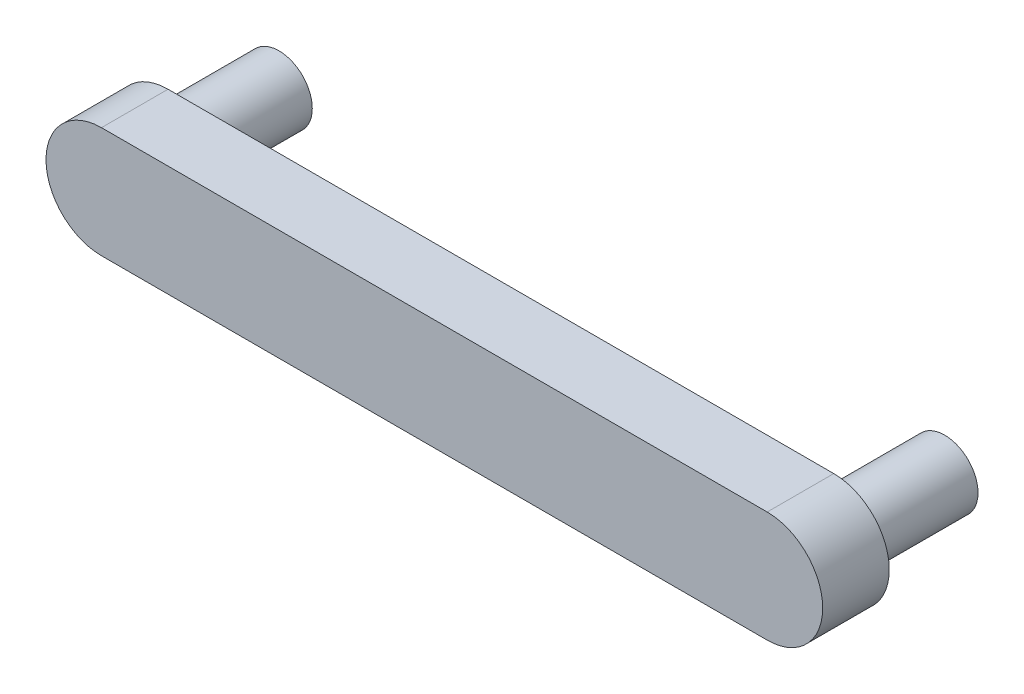
ISO-10303-21;
HEADER;
FILE_DESCRIPTION(('STEP AP214'),'2;1');
FILE_NAME('part.step','',(''),(''),'','','');
FILE_SCHEMA(('AUTOMOTIVE_DESIGN { 1 0 10303 214 1 1 1 1 }'));
ENDSEC;
DATA;
#1=APPLICATION_CONTEXT('core data for automotive mechanical design processes');
#2=APPLICATION_PROTOCOL_DEFINITION('international standard','automotive_design',2000,#1);
#3=PRODUCT_CONTEXT('',#1,'mechanical');
#4=PRODUCT('Part','Part','',(#3));
#5=PRODUCT_RELATED_PRODUCT_CATEGORY('part','',(#4));
#6=PRODUCT_DEFINITION_FORMATION('','',#4);
#7=PRODUCT_DEFINITION_CONTEXT('part definition',#1,'design');
#8=PRODUCT_DEFINITION('design','',#6,#7);
#9=PRODUCT_DEFINITION_SHAPE('','',#8);
#10=(LENGTH_UNIT() NAMED_UNIT(*) SI_UNIT(.MILLI.,.METRE.));
#11=(NAMED_UNIT(*) PLANE_ANGLE_UNIT() SI_UNIT($,.RADIAN.));
#12=(NAMED_UNIT(*) SI_UNIT($,.STERADIAN.) SOLID_ANGLE_UNIT());
#13=UNCERTAINTY_MEASURE_WITH_UNIT(LENGTH_MEASURE(1.E-05),#10,'distance_accuracy_value','');
#14=(GEOMETRIC_REPRESENTATION_CONTEXT(3) GLOBAL_UNCERTAINTY_ASSIGNED_CONTEXT((#13)) GLOBAL_UNIT_ASSIGNED_CONTEXT((#10,
#11,#12)) REPRESENTATION_CONTEXT('',''));
#15=CARTESIAN_POINT('',(0.,0.,0.));
#16=DIRECTION('',(0.,0.,1.));
#17=DIRECTION('',(1.,0.,0.));
#18=AXIS2_PLACEMENT_3D('',#15,#16,#17);
#19=CARTESIAN_POINT('',(15.0000000000001,0.,3.));
#20=DIRECTION('',(0.,0.,-1.));
#21=DIRECTION('',(-1.,0.,0.));
#22=AXIS2_PLACEMENT_3D('',#19,#20,#21);
#23=CYLINDRICAL_SURFACE('',#22,2.5);
#24=CARTESIAN_POINT('',(15.0000000000001,0.,0.));
#25=DIRECTION('',(0.,0.,1.));
#26=DIRECTION('',(-1.,0.,0.));
#27=AXIS2_PLACEMENT_3D('',#24,#25,#26);
#28=CIRCLE('',#27,2.5);
#29=CARTESIAN_POINT('',(15.0000000000001,-2.5,0.));
#30=VERTEX_POINT('',#29);
#31=CARTESIAN_POINT('',(15.0000000000001,2.5,0.));
#32=VERTEX_POINT('',#31);
#33=EDGE_CURVE('E102',#30,#32,#28,.T.);
#34=ORIENTED_EDGE('',*,*,#33,.T.);
#35=DIRECTION('',(0.,0.,-1.));
#36=VECTOR('',#35,1.);
#37=CARTESIAN_POINT('',(15.0000000000001,2.5,3.));
#38=LINE('',#37,#36);
#39=CARTESIAN_POINT('',(15.0000000000001,2.5,3.));
#40=VERTEX_POINT('',#39);
#41=EDGE_CURVE('E93',#40,#32,#38,.T.);
#42=ORIENTED_EDGE('',*,*,#41,.F.);
#43=CARTESIAN_POINT('',(15.0000000000001,0.,3.));
#44=DIRECTION('',(0.,0.,1.));
#45=DIRECTION('',(-1.,0.,0.));
#46=AXIS2_PLACEMENT_3D('',#43,#44,#45);
#47=CIRCLE('',#46,2.5);
#48=CARTESIAN_POINT('',(15.0000000000001,-2.5,3.));
#49=VERTEX_POINT('',#48);
#50=EDGE_CURVE('E87',#49,#40,#47,.T.);
#51=ORIENTED_EDGE('',*,*,#50,.F.);
#52=DIRECTION('',(0.,0.,-1.));
#53=VECTOR('',#52,1.);
#54=CARTESIAN_POINT('',(15.0000000000001,-2.5,3.));
#55=LINE('',#54,#53);
#56=EDGE_CURVE('E98',#49,#30,#55,.T.);
#57=ORIENTED_EDGE('',*,*,#56,.T.);
#58=EDGE_LOOP('',(#34,#42,#51,#57));
#59=FACE_BOUND('',#58,.T.);
#60=ADVANCED_FACE('F35',(#59),#23,.T.);
#61=CARTESIAN_POINT('',(-15.0000000000002,2.50000000000001,3.));
#62=DIRECTION('',(0.,-1.,0.));
#63=DIRECTION('',(1.,0.,0.));
#64=AXIS2_PLACEMENT_3D('',#61,#62,#63);
#65=PLANE('',#64);
#66=DIRECTION('',(-1.,0.,0.));
#67=VECTOR('',#66,1.);
#68=CARTESIAN_POINT('',(-15.0000000000002,2.50000000000001,0.));
#69=LINE('',#68,#67);
#70=CARTESIAN_POINT('',(-15.0000000000002,2.50000000000001,0.));
#71=VERTEX_POINT('',#70);
#72=EDGE_CURVE('E92',#32,#71,#69,.T.);
#73=ORIENTED_EDGE('',*,*,#72,.T.);
#74=DIRECTION('',(0.,0.,-1.));
#75=VECTOR('',#74,1.);
#76=CARTESIAN_POINT('',(-15.0000000000002,2.50000000000001,3.));
#77=LINE('',#76,#75);
#78=CARTESIAN_POINT('',(-15.0000000000002,2.50000000000001,3.));
#79=VERTEX_POINT('',#78);
#80=EDGE_CURVE('E90',#79,#71,#77,.T.);
#81=ORIENTED_EDGE('',*,*,#80,.F.);
#82=DIRECTION('',(-1.,0.,0.));
#83=VECTOR('',#82,1.);
#84=CARTESIAN_POINT('',(-15.0000000000002,2.50000000000001,3.));
#85=LINE('',#84,#83);
#86=EDGE_CURVE('E82',#40,#79,#85,.T.);
#87=ORIENTED_EDGE('',*,*,#86,.F.);
#88=ORIENTED_EDGE('',*,*,#41,.T.);
#89=EDGE_LOOP('',(#73,#81,#87,#88));
#90=FACE_BOUND('',#89,.T.);
#91=ADVANCED_FACE('F91',(#90),#65,.F.);
#92=CARTESIAN_POINT('',(-15.0000000000001,0.,3.));
#93=DIRECTION('',(0.,0.,-1.));
#94=DIRECTION('',(-1.,0.,0.));
#95=AXIS2_PLACEMENT_3D('',#92,#93,#94);
#96=CYLINDRICAL_SURFACE('',#95,2.5);
#97=CARTESIAN_POINT('',(-15.0000000000001,0.,0.));
#98=DIRECTION('',(0.,0.,1.));
#99=DIRECTION('',(1.,0.,0.));
#100=AXIS2_PLACEMENT_3D('',#97,#98,#99);
#101=CIRCLE('',#100,2.5);
#102=CARTESIAN_POINT('',(-14.9999999999999,-2.5,0.));
#103=VERTEX_POINT('',#102);
#104=EDGE_CURVE('E68',#71,#103,#101,.T.);
#105=ORIENTED_EDGE('',*,*,#104,.T.);
#106=DIRECTION('',(0.,0.,-1.));
#107=VECTOR('',#106,1.);
#108=CARTESIAN_POINT('',(-14.9999999999999,-2.5,3.));
#109=LINE('',#108,#107);
#110=CARTESIAN_POINT('',(-14.9999999999999,-2.5,3.));
#111=VERTEX_POINT('',#110);
#112=EDGE_CURVE('E94',#111,#103,#109,.T.);
#113=ORIENTED_EDGE('',*,*,#112,.F.);
#114=CARTESIAN_POINT('',(-15.0000000000001,0.,3.));
#115=DIRECTION('',(0.,0.,1.));
#116=DIRECTION('',(1.,0.,0.));
#117=AXIS2_PLACEMENT_3D('',#114,#115,#116);
#118=CIRCLE('',#117,2.5);
#119=EDGE_CURVE('E85',#79,#111,#118,.T.);
#120=ORIENTED_EDGE('',*,*,#119,.F.);
#121=ORIENTED_EDGE('',*,*,#80,.T.);
#122=EDGE_LOOP('',(#105,#113,#120,#121));
#123=FACE_BOUND('',#122,.T.);
#124=ADVANCED_FACE('F96',(#123),#96,.T.);
#125=CARTESIAN_POINT('',(-14.9999999999999,-2.5,3.));
#126=DIRECTION('',(0.,1.,0.));
#127=DIRECTION('',(0.,0.,1.));
#128=AXIS2_PLACEMENT_3D('',#125,#126,#127);
#129=PLANE('',#128);
#130=DIRECTION('',(1.,0.,0.));
#131=VECTOR('',#130,1.);
#132=CARTESIAN_POINT('',(-14.9999999999999,-2.5,0.));
#133=LINE('',#132,#131);
#134=EDGE_CURVE('E74',#103,#30,#133,.T.);
#135=ORIENTED_EDGE('',*,*,#134,.T.);
#136=ORIENTED_EDGE('',*,*,#56,.F.);
#137=DIRECTION('',(1.,0.,0.));
#138=VECTOR('',#137,1.);
#139=CARTESIAN_POINT('',(-14.9999999999999,-2.5,3.));
#140=LINE('',#139,#138);
#141=EDGE_CURVE('E51',#111,#49,#140,.T.);
#142=ORIENTED_EDGE('',*,*,#141,.F.);
#143=ORIENTED_EDGE('',*,*,#112,.T.);
#144=EDGE_LOOP('',(#135,#136,#142,#143));
#145=FACE_BOUND('',#144,.T.);
#146=ADVANCED_FACE('F123',(#145),#129,.F.);
#147=CARTESIAN_POINT('',(15.0000000000001,0.,3.));
#148=DIRECTION('',(0.,0.,-1.));
#149=DIRECTION('',(-1.,0.,0.));
#150=AXIS2_PLACEMENT_3D('',#147,#148,#149);
#151=PLANE('',#150);
#152=ORIENTED_EDGE('',*,*,#50,.T.);
#153=ORIENTED_EDGE('',*,*,#86,.T.);
#154=ORIENTED_EDGE('',*,*,#119,.T.);
#155=ORIENTED_EDGE('',*,*,#141,.T.);
#156=EDGE_LOOP('',(#152,#153,#154,#155));
#157=FACE_BOUND('',#156,.T.);
#158=ADVANCED_FACE('F83',(#157),#151,.F.);
#159=CARTESIAN_POINT('',(15.0000000000001,0.,0.));
#160=DIRECTION('',(0.,0.,-1.));
#161=DIRECTION('',(-1.,0.,0.));
#162=AXIS2_PLACEMENT_3D('',#159,#160,#161);
#163=PLANE('',#162);
#164=CARTESIAN_POINT('',(15.0000000000001,0.,0.));
#165=DIRECTION('',(0.,0.,-1.));
#166=DIRECTION('',(-1.,0.,0.));
#167=AXIS2_PLACEMENT_3D('',#164,#165,#166);
#168=CIRCLE('',#167,1.5);
#169=CARTESIAN_POINT('',(13.5000000000001,0.,0.));
#170=VERTEX_POINT('',#169);
#171=EDGE_CURVE('E11',#170,#170,#168,.T.);
#172=ORIENTED_EDGE('',*,*,#171,.F.);
#173=EDGE_LOOP('',(#172));
#174=FACE_BOUND('',#173,.T.);
#175=CARTESIAN_POINT('',(-15.0000000000001,0.,0.));
#176=DIRECTION('',(0.,0.,-1.));
#177=DIRECTION('',(-1.,0.,0.));
#178=AXIS2_PLACEMENT_3D('',#175,#176,#177);
#179=CIRCLE('',#178,1.5);
#180=CARTESIAN_POINT('',(-16.5000000000001,0.,0.));
#181=VERTEX_POINT('',#180);
#182=EDGE_CURVE('E43',#181,#181,#179,.T.);
#183=ORIENTED_EDGE('',*,*,#182,.F.);
#184=EDGE_LOOP('',(#183));
#185=FACE_BOUND('',#184,.T.);
#186=ORIENTED_EDGE('',*,*,#33,.F.);
#187=ORIENTED_EDGE('',*,*,#134,.F.);
#188=ORIENTED_EDGE('',*,*,#104,.F.);
#189=ORIENTED_EDGE('',*,*,#72,.F.);
#190=EDGE_LOOP('',(#186,#187,#188,#189));
#191=FACE_BOUND('',#190,.T.);
#192=ADVANCED_FACE('F116',(#174,#185,#191),#163,.T.);
#193=CARTESIAN_POINT('',(-15.0000000000001,0.,-5.));
#194=DIRECTION('',(0.,0.,1.));
#195=DIRECTION('',(1.,0.,0.));
#196=AXIS2_PLACEMENT_3D('',#193,#194,#195);
#197=CYLINDRICAL_SURFACE('',#196,1.5);
#198=CARTESIAN_POINT('',(-15.0000000000001,0.,-5.));
#199=DIRECTION('',(0.,0.,1.));
#200=DIRECTION('',(1.,0.,0.));
#201=AXIS2_PLACEMENT_3D('',#198,#199,#200);
#202=CIRCLE('',#201,1.5);
#203=CARTESIAN_POINT('',(-13.5000000000001,0.,-5.));
#204=VERTEX_POINT('',#203);
#205=EDGE_CURVE('E105',#204,#204,#202,.T.);
#206=ORIENTED_EDGE('',*,*,#205,.T.);
#207=EDGE_LOOP('',(#206));
#208=FACE_BOUND('',#207,.T.);
#209=ORIENTED_EDGE('',*,*,#182,.T.);
#210=EDGE_LOOP('',(#209));
#211=FACE_BOUND('',#210,.T.);
#212=ADVANCED_FACE('F114',(#208,#211),#197,.T.);
#213=CARTESIAN_POINT('',(-15.0000000000001,0.,-5.));
#214=DIRECTION('',(0.,0.,1.));
#215=DIRECTION('',(1.,0.,0.));
#216=AXIS2_PLACEMENT_3D('',#213,#214,#215);
#217=PLANE('',#216);
#218=ORIENTED_EDGE('',*,*,#205,.F.);
#219=EDGE_LOOP('',(#218));
#220=FACE_BOUND('',#219,.T.);
#221=ADVANCED_FACE('F167',(#220),#217,.F.);
#222=CARTESIAN_POINT('',(15.0000000000001,0.,-5.));
#223=DIRECTION('',(0.,0.,1.));
#224=DIRECTION('',(1.,0.,0.));
#225=AXIS2_PLACEMENT_3D('',#222,#223,#224);
#226=CYLINDRICAL_SURFACE('',#225,1.5);
#227=CARTESIAN_POINT('',(15.0000000000001,0.,-5.));
#228=DIRECTION('',(0.,0.,1.));
#229=DIRECTION('',(1.,0.,0.));
#230=AXIS2_PLACEMENT_3D('',#227,#228,#229);
#231=CIRCLE('',#230,1.5);
#232=CARTESIAN_POINT('',(16.5000000000001,0.,-5.));
#233=VERTEX_POINT('',#232);
#234=EDGE_CURVE('E203',#233,#233,#231,.T.);
#235=ORIENTED_EDGE('',*,*,#234,.T.);
#236=EDGE_LOOP('',(#235));
#237=FACE_BOUND('',#236,.T.);
#238=ORIENTED_EDGE('',*,*,#171,.T.);
#239=EDGE_LOOP('',(#238));
#240=FACE_BOUND('',#239,.T.);
#241=ADVANCED_FACE('F177',(#237,#240),#226,.T.);
#242=CARTESIAN_POINT('',(15.0000000000001,0.,-5.));
#243=DIRECTION('',(0.,0.,1.));
#244=DIRECTION('',(1.,0.,0.));
#245=AXIS2_PLACEMENT_3D('',#242,#243,#244);
#246=PLANE('',#245);
#247=ORIENTED_EDGE('',*,*,#234,.F.);
#248=EDGE_LOOP('',(#247));
#249=FACE_BOUND('',#248,.T.);
#250=ADVANCED_FACE('F187',(#249),#246,.F.);
#251=CLOSED_SHELL('',(#60,#91,#124,#146,#158,#192,#212,#221,#241,#250));
#252=MANIFOLD_SOLID_BREP('B2',#251);
#253=ADVANCED_BREP_SHAPE_REPRESENTATION('',(#18,#252),#14);
#254=SHAPE_DEFINITION_REPRESENTATION(#9,#253);
ENDSEC;
END-ISO-10303-21;
